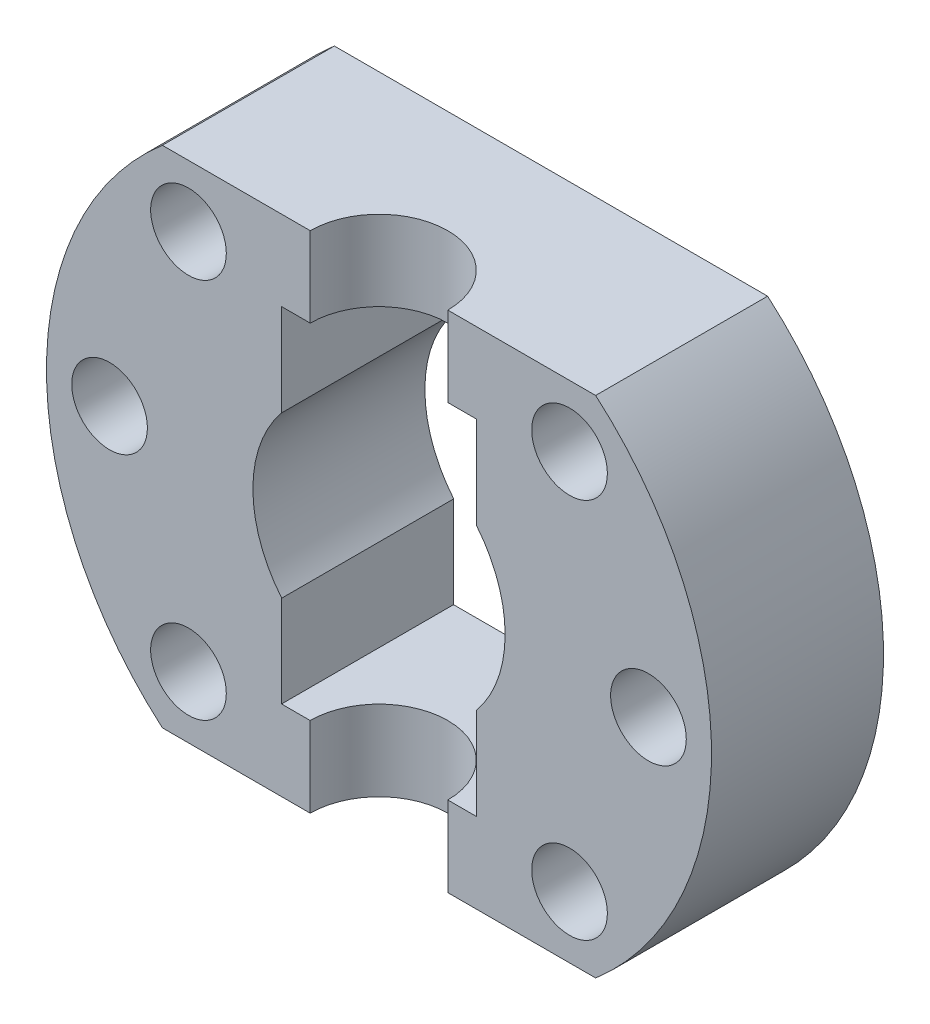
ISO-10303-21;
HEADER;
FILE_DESCRIPTION(('STEP AP214'),'2;1');
FILE_NAME('part.step','',(''),(''),'','','');
FILE_SCHEMA(('AUTOMOTIVE_DESIGN { 1 0 10303 214 1 1 1 1 }'));
ENDSEC;
DATA;
#1=APPLICATION_CONTEXT('core data for automotive mechanical design processes');
#2=APPLICATION_PROTOCOL_DEFINITION('international standard','automotive_design',2000,#1);
#3=PRODUCT_CONTEXT('',#1,'mechanical');
#4=PRODUCT('Part','Part','',(#3));
#5=PRODUCT_RELATED_PRODUCT_CATEGORY('part','',(#4));
#6=PRODUCT_DEFINITION_FORMATION('','',#4);
#7=PRODUCT_DEFINITION_CONTEXT('part definition',#1,'design');
#8=PRODUCT_DEFINITION('design','',#6,#7);
#9=PRODUCT_DEFINITION_SHAPE('','',#8);
#10=(LENGTH_UNIT() NAMED_UNIT(*) SI_UNIT(.MILLI.,.METRE.));
#11=(NAMED_UNIT(*) PLANE_ANGLE_UNIT() SI_UNIT($,.RADIAN.));
#12=(NAMED_UNIT(*) SI_UNIT($,.STERADIAN.) SOLID_ANGLE_UNIT());
#13=UNCERTAINTY_MEASURE_WITH_UNIT(LENGTH_MEASURE(1.E-05),#10,'distance_accuracy_value','');
#14=(GEOMETRIC_REPRESENTATION_CONTEXT(3) GLOBAL_UNCERTAINTY_ASSIGNED_CONTEXT((#13)) GLOBAL_UNIT_ASSIGNED_CONTEXT((#10,
#11,#12)) REPRESENTATION_CONTEXT('',''));
#15=CARTESIAN_POINT('',(0.,0.,0.));
#16=DIRECTION('',(0.,0.,1.));
#17=DIRECTION('',(1.,0.,0.));
#18=AXIS2_PLACEMENT_3D('',#15,#16,#17);
#19=CARTESIAN_POINT('',(0.,0.,15.));
#20=DIRECTION('',(0.,0.,1.));
#21=DIRECTION('',(1.,0.,0.));
#22=AXIS2_PLACEMENT_3D('',#19,#20,#21);
#23=PLANE('',#22);
#24=DIRECTION('',(0.,-1.,0.));
#25=VECTOR('',#24,1.);
#26=CARTESIAN_POINT('',(-6.00000000000001,22.,15.));
#27=LINE('',#26,#25);
#28=CARTESIAN_POINT('',(-6.00000000000001,22.,15.));
#29=VERTEX_POINT('',#28);
#30=CARTESIAN_POINT('',(-6.00000000000001,15.0178799781155,15.));
#31=VERTEX_POINT('',#30);
#32=EDGE_CURVE('E60',#29,#31,#27,.T.);
#33=ORIENTED_EDGE('',*,*,#32,.F.);
#34=DIRECTION('',(-1.,0.,0.));
#35=VECTOR('',#34,1.);
#36=CARTESIAN_POINT('',(-18.8944436276912,22.,15.));
#37=LINE('',#36,#35);
#38=CARTESIAN_POINT('',(-18.8944436276912,22.,15.));
#39=VERTEX_POINT('',#38);
#40=EDGE_CURVE('E183',#29,#39,#37,.T.);
#41=ORIENTED_EDGE('',*,*,#40,.T.);
#42=CARTESIAN_POINT('',(0.,0.,15.));
#43=DIRECTION('',(0.,0.,1.));
#44=DIRECTION('',(1.,0.,0.));
#45=AXIS2_PLACEMENT_3D('',#42,#43,#44);
#46=CIRCLE('',#45,29.);
#47=CARTESIAN_POINT('',(-18.8944436276912,-22.,15.));
#48=VERTEX_POINT('',#47);
#49=EDGE_CURVE('E208',#39,#48,#46,.T.);
#50=ORIENTED_EDGE('',*,*,#49,.T.);
#51=DIRECTION('',(1.,0.,0.));
#52=VECTOR('',#51,1.);
#53=CARTESIAN_POINT('',(-18.8944436276912,-22.,15.));
#54=LINE('',#53,#52);
#55=CARTESIAN_POINT('',(-6.00000000000001,-22.,15.));
#56=VERTEX_POINT('',#55);
#57=EDGE_CURVE('E337',#48,#56,#54,.T.);
#58=ORIENTED_EDGE('',*,*,#57,.T.);
#59=CARTESIAN_POINT('',(-6.00000000000001,-15.,15.));
#60=VERTEX_POINT('',#59);
#61=EDGE_CURVE('E353',#60,#56,#27,.T.);
#62=ORIENTED_EDGE('',*,*,#61,.F.);
#63=DIRECTION('',(1.,0.,0.));
#64=VECTOR('',#63,1.);
#65=CARTESIAN_POINT('',(-8.49999999999999,-15.,15.));
#66=LINE('',#65,#64);
#67=CARTESIAN_POINT('',(-8.49999999999999,-15.,15.));
#68=VERTEX_POINT('',#67);
#69=EDGE_CURVE('E368',#68,#60,#66,.T.);
#70=ORIENTED_EDGE('',*,*,#69,.F.);
#71=DIRECTION('',(0.,-1.,0.));
#72=VECTOR('',#71,1.);
#73=CARTESIAN_POINT('',(-8.49999999999999,-7.,15.));
#74=LINE('',#73,#72);
#75=CARTESIAN_POINT('',(-8.49999999999999,-7.,15.));
#76=VERTEX_POINT('',#75);
#77=EDGE_CURVE('E369',#76,#68,#74,.T.);
#78=ORIENTED_EDGE('',*,*,#77,.F.);
#79=DIRECTION('',(1.,0.,0.));
#80=VECTOR('',#79,1.);
#81=CARTESIAN_POINT('',(-8.49999999999999,-7.,15.));
#82=LINE('',#81,#80);
#83=CARTESIAN_POINT('',(-8.48528137423857,-7.,15.));
#84=VERTEX_POINT('',#83);
#85=EDGE_CURVE('E379',#76,#84,#82,.T.);
#86=ORIENTED_EDGE('',*,*,#85,.T.);
#87=CARTESIAN_POINT('',(0.,0.,15.));
#88=DIRECTION('',(0.,0.,1.));
#89=DIRECTION('',(1.,0.,0.));
#90=AXIS2_PLACEMENT_3D('',#87,#88,#89);
#91=CIRCLE('',#90,11.);
#92=CARTESIAN_POINT('',(-8.5,6.98212002188447,15.));
#93=VERTEX_POINT('',#92);
#94=EDGE_CURVE('E228',#93,#84,#91,.T.);
#95=ORIENTED_EDGE('',*,*,#94,.F.);
#96=DIRECTION('',(0.,-1.,0.));
#97=VECTOR('',#96,1.);
#98=CARTESIAN_POINT('',(-8.5,15.0178799781155,15.));
#99=LINE('',#98,#97);
#100=CARTESIAN_POINT('',(-8.5,15.0178799781155,15.));
#101=VERTEX_POINT('',#100);
#102=EDGE_CURVE('E373',#101,#93,#99,.T.);
#103=ORIENTED_EDGE('',*,*,#102,.F.);
#104=DIRECTION('',(1.,0.,0.));
#105=VECTOR('',#104,1.);
#106=CARTESIAN_POINT('',(-8.5,15.0178799781155,15.));
#107=LINE('',#106,#105);
#108=EDGE_CURVE('E350',#101,#31,#107,.T.);
#109=ORIENTED_EDGE('',*,*,#108,.T.);
#110=EDGE_LOOP('',(#33,#41,#50,#58,#62,#70,#78,#86,#95,#103,#109));
#111=FACE_BOUND('',#110,.T.);
#112=CARTESIAN_POINT('',(-16.6170093578839,-16.6170093578839,15.));
#113=DIRECTION('',(0.,0.,1.));
#114=DIRECTION('',(1.,0.,0.));
#115=AXIS2_PLACEMENT_3D('',#112,#113,#114);
#116=CIRCLE('',#115,3.29999999999986);
#117=CARTESIAN_POINT('',(-13.317009357884,-16.6170093578839,15.));
#118=VERTEX_POINT('',#117);
#119=EDGE_CURVE('E407',#118,#118,#116,.T.);
#120=ORIENTED_EDGE('',*,*,#119,.F.);
#121=EDGE_LOOP('',(#120));
#122=FACE_BOUND('',#121,.T.);
#123=CARTESIAN_POINT('',(-16.6170093578838,16.6170093578839,15.));
#124=DIRECTION('',(0.,0.,1.));
#125=DIRECTION('',(1.,0.,0.));
#126=AXIS2_PLACEMENT_3D('',#123,#124,#125);
#127=CIRCLE('',#126,3.3);
#128=CARTESIAN_POINT('',(-13.3170093578838,16.6170093578839,15.));
#129=VERTEX_POINT('',#128);
#130=EDGE_CURVE('E247',#129,#129,#127,.T.);
#131=ORIENTED_EDGE('',*,*,#130,.F.);
#132=EDGE_LOOP('',(#131));
#133=FACE_BOUND('',#132,.T.);
#134=CARTESIAN_POINT('',(-23.5,0.,15.));
#135=DIRECTION('',(0.,0.,1.));
#136=DIRECTION('',(1.,0.,0.));
#137=AXIS2_PLACEMENT_3D('',#134,#135,#136);
#138=CIRCLE('',#137,3.3);
#139=CARTESIAN_POINT('',(-20.2,0.,15.));
#140=VERTEX_POINT('',#139);
#141=EDGE_CURVE('E203',#140,#140,#138,.T.);
#142=ORIENTED_EDGE('',*,*,#141,.F.);
#143=EDGE_LOOP('',(#142));
#144=FACE_BOUND('',#143,.T.);
#145=ADVANCED_FACE('F45',(#111,#122,#133,#144),#23,.T.);
#146=DIRECTION('',(0.,-1.,0.));
#147=VECTOR('',#146,1.);
#148=CARTESIAN_POINT('',(5.99999999999999,22.,15.));
#149=LINE('',#148,#147);
#150=CARTESIAN_POINT('',(5.99999999999999,-22.,15.));
#151=VERTEX_POINT('',#150);
#152=CARTESIAN_POINT('',(5.99999999999999,-15.,15.));
#153=VERTEX_POINT('',#152);
#154=EDGE_CURVE('E68',#151,#153,#149,.F.);
#155=ORIENTED_EDGE('',*,*,#154,.F.);
#156=CARTESIAN_POINT('',(18.8944436276912,-22.,15.));
#157=VERTEX_POINT('',#156);
#158=EDGE_CURVE('E335',#151,#157,#54,.T.);
#159=ORIENTED_EDGE('',*,*,#158,.T.);
#160=CARTESIAN_POINT('',(0.,0.,15.));
#161=DIRECTION('',(0.,0.,1.));
#162=DIRECTION('',(1.,0.,0.));
#163=AXIS2_PLACEMENT_3D('',#160,#161,#162);
#164=CIRCLE('',#163,29.);
#165=CARTESIAN_POINT('',(18.8944436276912,22.,15.));
#166=VERTEX_POINT('',#165);
#167=EDGE_CURVE('E189',#157,#166,#164,.T.);
#168=ORIENTED_EDGE('',*,*,#167,.T.);
#169=CARTESIAN_POINT('',(5.99999999999999,22.,15.));
#170=VERTEX_POINT('',#169);
#171=EDGE_CURVE('E181',#166,#170,#37,.T.);
#172=ORIENTED_EDGE('',*,*,#171,.T.);
#173=CARTESIAN_POINT('',(5.99999999999999,15.0178799781155,15.));
#174=VERTEX_POINT('',#173);
#175=EDGE_CURVE('E167',#174,#170,#149,.F.);
#176=ORIENTED_EDGE('',*,*,#175,.F.);
#177=CARTESIAN_POINT('',(8.5,15.0178799781155,15.));
#178=VERTEX_POINT('',#177);
#179=EDGE_CURVE('E400',#174,#178,#107,.T.);
#180=ORIENTED_EDGE('',*,*,#179,.T.);
#181=DIRECTION('',(0.,-1.,0.));
#182=VECTOR('',#181,1.);
#183=CARTESIAN_POINT('',(8.5,15.0178799781155,15.));
#184=LINE('',#183,#182);
#185=CARTESIAN_POINT('',(8.5,6.98212002188447,15.));
#186=VERTEX_POINT('',#185);
#187=EDGE_CURVE('E399',#178,#186,#184,.T.);
#188=ORIENTED_EDGE('',*,*,#187,.T.);
#189=CARTESIAN_POINT('',(8.48528137423857,-7.,15.));
#190=VERTEX_POINT('',#189);
#191=EDGE_CURVE('E241',#190,#186,#91,.T.);
#192=ORIENTED_EDGE('',*,*,#191,.F.);
#193=CARTESIAN_POINT('',(8.5,-7.,15.));
#194=VERTEX_POINT('',#193);
#195=EDGE_CURVE('E378',#190,#194,#82,.T.);
#196=ORIENTED_EDGE('',*,*,#195,.T.);
#197=DIRECTION('',(0.,-1.,0.));
#198=VECTOR('',#197,1.);
#199=CARTESIAN_POINT('',(8.5,-7.,15.));
#200=LINE('',#199,#198);
#201=CARTESIAN_POINT('',(8.50000000000001,-15.,15.));
#202=VERTEX_POINT('',#201);
#203=EDGE_CURVE('E364',#194,#202,#200,.T.);
#204=ORIENTED_EDGE('',*,*,#203,.T.);
#205=EDGE_CURVE('E361',#153,#202,#66,.T.);
#206=ORIENTED_EDGE('',*,*,#205,.F.);
#207=EDGE_LOOP('',(#155,#159,#168,#172,#176,#180,#188,#192,#196,#204,#206));
#208=FACE_BOUND('',#207,.T.);
#209=CARTESIAN_POINT('',(16.6170093578837,-16.617009357884,15.));
#210=DIRECTION('',(0.,0.,1.));
#211=DIRECTION('',(1.,0.,0.));
#212=AXIS2_PLACEMENT_3D('',#209,#210,#211);
#213=CIRCLE('',#212,3.3);
#214=CARTESIAN_POINT('',(19.9170093578837,-16.617009357884,15.));
#215=VERTEX_POINT('',#214);
#216=EDGE_CURVE('E287',#215,#215,#213,.T.);
#217=ORIENTED_EDGE('',*,*,#216,.F.);
#218=EDGE_LOOP('',(#217));
#219=FACE_BOUND('',#218,.T.);
#220=CARTESIAN_POINT('',(16.617009357884,16.6170093578838,15.));
#221=DIRECTION('',(0.,0.,1.));
#222=DIRECTION('',(1.,0.,0.));
#223=AXIS2_PLACEMENT_3D('',#220,#221,#222);
#224=CIRCLE('',#223,3.3);
#225=CARTESIAN_POINT('',(19.917009357884,16.6170093578838,15.));
#226=VERTEX_POINT('',#225);
#227=EDGE_CURVE('E275',#226,#226,#224,.T.);
#228=ORIENTED_EDGE('',*,*,#227,.F.);
#229=EDGE_LOOP('',(#228));
#230=FACE_BOUND('',#229,.T.);
#231=CARTESIAN_POINT('',(23.5,-1.64099622925627E-13,15.));
#232=DIRECTION('',(0.,0.,1.));
#233=DIRECTION('',(1.,0.,0.));
#234=AXIS2_PLACEMENT_3D('',#231,#232,#233);
#235=CIRCLE('',#234,3.3);
#236=CARTESIAN_POINT('',(26.8,-1.64099622925627E-13,15.));
#237=VERTEX_POINT('',#236);
#238=EDGE_CURVE('E286',#237,#237,#235,.T.);
#239=ORIENTED_EDGE('',*,*,#238,.F.);
#240=EDGE_LOOP('',(#239));
#241=FACE_BOUND('',#240,.T.);
#242=ADVANCED_FACE('F186',(#208,#219,#230,#241),#23,.T.);
#243=CARTESIAN_POINT('',(0.,0.,0.));
#244=DIRECTION('',(0.,0.,1.));
#245=DIRECTION('',(1.,0.,0.));
#246=AXIS2_PLACEMENT_3D('',#243,#244,#245);
#247=PLANE('',#246);
#248=CARTESIAN_POINT('',(-16.6170093578839,-16.6170093578839,0.));
#249=DIRECTION('',(0.,0.,1.));
#250=DIRECTION('',(1.,0.,0.));
#251=AXIS2_PLACEMENT_3D('',#248,#249,#250);
#252=CIRCLE('',#251,3.29999999999986);
#253=CARTESIAN_POINT('',(-13.317009357884,-16.6170093578839,0.));
#254=VERTEX_POINT('',#253);
#255=EDGE_CURVE('E384',#254,#254,#252,.T.);
#256=ORIENTED_EDGE('',*,*,#255,.T.);
#257=EDGE_LOOP('',(#256));
#258=FACE_BOUND('',#257,.T.);
#259=CARTESIAN_POINT('',(16.6170093578837,-16.617009357884,0.));
#260=DIRECTION('',(0.,0.,1.));
#261=DIRECTION('',(1.,0.,0.));
#262=AXIS2_PLACEMENT_3D('',#259,#260,#261);
#263=CIRCLE('',#262,3.3);
#264=CARTESIAN_POINT('',(19.9170093578837,-16.617009357884,0.));
#265=VERTEX_POINT('',#264);
#266=EDGE_CURVE('E412',#265,#265,#263,.T.);
#267=ORIENTED_EDGE('',*,*,#266,.T.);
#268=EDGE_LOOP('',(#267));
#269=FACE_BOUND('',#268,.T.);
#270=CARTESIAN_POINT('',(23.5,-1.64099622925627E-13,0.));
#271=DIRECTION('',(0.,0.,1.));
#272=DIRECTION('',(1.,0.,0.));
#273=AXIS2_PLACEMENT_3D('',#270,#271,#272);
#274=CIRCLE('',#273,3.3);
#275=CARTESIAN_POINT('',(26.8,-1.64099622925627E-13,0.));
#276=VERTEX_POINT('',#275);
#277=EDGE_CURVE('E281',#276,#276,#274,.T.);
#278=ORIENTED_EDGE('',*,*,#277,.T.);
#279=EDGE_LOOP('',(#278));
#280=FACE_BOUND('',#279,.T.);
#281=CARTESIAN_POINT('',(16.617009357884,16.6170093578838,0.));
#282=DIRECTION('',(0.,0.,1.));
#283=DIRECTION('',(1.,0.,0.));
#284=AXIS2_PLACEMENT_3D('',#281,#282,#283);
#285=CIRCLE('',#284,3.3);
#286=CARTESIAN_POINT('',(19.917009357884,16.6170093578838,0.));
#287=VERTEX_POINT('',#286);
#288=EDGE_CURVE('E270',#287,#287,#285,.T.);
#289=ORIENTED_EDGE('',*,*,#288,.T.);
#290=EDGE_LOOP('',(#289));
#291=FACE_BOUND('',#290,.T.);
#292=CARTESIAN_POINT('',(-16.6170093578838,16.6170093578839,0.));
#293=DIRECTION('',(0.,0.,1.));
#294=DIRECTION('',(1.,0.,0.));
#295=AXIS2_PLACEMENT_3D('',#292,#293,#294);
#296=CIRCLE('',#295,3.3);
#297=CARTESIAN_POINT('',(-13.3170093578838,16.6170093578839,0.));
#298=VERTEX_POINT('',#297);
#299=EDGE_CURVE('E269',#298,#298,#296,.T.);
#300=ORIENTED_EDGE('',*,*,#299,.T.);
#301=EDGE_LOOP('',(#300));
#302=FACE_BOUND('',#301,.T.);
#303=CARTESIAN_POINT('',(-23.5,0.,0.));
#304=DIRECTION('',(0.,0.,1.));
#305=DIRECTION('',(1.,0.,0.));
#306=AXIS2_PLACEMENT_3D('',#303,#304,#305);
#307=CIRCLE('',#306,3.3);
#308=CARTESIAN_POINT('',(-20.2,0.,0.));
#309=VERTEX_POINT('',#308);
#310=EDGE_CURVE('E254',#309,#309,#307,.T.);
#311=ORIENTED_EDGE('',*,*,#310,.T.);
#312=EDGE_LOOP('',(#311));
#313=FACE_BOUND('',#312,.T.);
#314=CARTESIAN_POINT('',(0.,0.,0.));
#315=DIRECTION('',(0.,0.,1.));
#316=DIRECTION('',(1.,0.,0.));
#317=AXIS2_PLACEMENT_3D('',#314,#315,#316);
#318=CIRCLE('',#317,29.);
#319=CARTESIAN_POINT('',(-18.8944436276912,22.,0.));
#320=VERTEX_POINT('',#319);
#321=CARTESIAN_POINT('',(-18.8944436276912,-22.,0.));
#322=VERTEX_POINT('',#321);
#323=EDGE_CURVE('E199',#320,#322,#318,.T.);
#324=ORIENTED_EDGE('',*,*,#323,.F.);
#325=DIRECTION('',(-1.,0.,0.));
#326=VECTOR('',#325,1.);
#327=CARTESIAN_POINT('',(-18.8944436276912,22.,0.));
#328=LINE('',#327,#326);
#329=CARTESIAN_POINT('',(18.8944436276912,22.,0.));
#330=VERTEX_POINT('',#329);
#331=EDGE_CURVE('E207',#330,#320,#328,.T.);
#332=ORIENTED_EDGE('',*,*,#331,.F.);
#333=CARTESIAN_POINT('',(0.,0.,0.));
#334=DIRECTION('',(0.,0.,1.));
#335=DIRECTION('',(1.,0.,0.));
#336=AXIS2_PLACEMENT_3D('',#333,#334,#335);
#337=CIRCLE('',#336,29.);
#338=CARTESIAN_POINT('',(18.8944436276912,-22.,0.));
#339=VERTEX_POINT('',#338);
#340=EDGE_CURVE('E205',#339,#330,#337,.T.);
#341=ORIENTED_EDGE('',*,*,#340,.F.);
#342=DIRECTION('',(1.,0.,0.));
#343=VECTOR('',#342,1.);
#344=CARTESIAN_POINT('',(-18.8944436276912,-22.,0.));
#345=LINE('',#344,#343);
#346=EDGE_CURVE('E202',#322,#339,#345,.T.);
#347=ORIENTED_EDGE('',*,*,#346,.F.);
#348=EDGE_LOOP('',(#324,#332,#341,#347));
#349=FACE_BOUND('',#348,.T.);
#350=DIRECTION('',(1.,0.,0.));
#351=VECTOR('',#350,1.);
#352=CARTESIAN_POINT('',(-8.49999999999999,-7.,0.));
#353=LINE('',#352,#351);
#354=CARTESIAN_POINT('',(-8.49999999999999,-7.,0.));
#355=VERTEX_POINT('',#354);
#356=CARTESIAN_POINT('',(-8.48528137423857,-7.,0.));
#357=VERTEX_POINT('',#356);
#358=EDGE_CURVE('E237',#355,#357,#353,.T.);
#359=ORIENTED_EDGE('',*,*,#358,.F.);
#360=DIRECTION('',(0.,-1.,0.));
#361=VECTOR('',#360,1.);
#362=CARTESIAN_POINT('',(-8.49999999999999,-7.,0.));
#363=LINE('',#362,#361);
#364=CARTESIAN_POINT('',(-8.49999999999999,-15.,0.));
#365=VERTEX_POINT('',#364);
#366=EDGE_CURVE('E381',#355,#365,#363,.T.);
#367=ORIENTED_EDGE('',*,*,#366,.T.);
#368=DIRECTION('',(1.,0.,0.));
#369=VECTOR('',#368,1.);
#370=CARTESIAN_POINT('',(-8.49999999999999,-15.,0.));
#371=LINE('',#370,#369);
#372=CARTESIAN_POINT('',(8.50000000000001,-15.,0.));
#373=VERTEX_POINT('',#372);
#374=EDGE_CURVE('E463',#365,#373,#371,.T.);
#375=ORIENTED_EDGE('',*,*,#374,.T.);
#376=DIRECTION('',(0.,-1.,0.));
#377=VECTOR('',#376,1.);
#378=CARTESIAN_POINT('',(8.5,-7.,0.));
#379=LINE('',#378,#377);
#380=CARTESIAN_POINT('',(8.5,-7.,0.));
#381=VERTEX_POINT('',#380);
#382=EDGE_CURVE('E460',#381,#373,#379,.T.);
#383=ORIENTED_EDGE('',*,*,#382,.F.);
#384=CARTESIAN_POINT('',(8.48528137423857,-7.,0.));
#385=VERTEX_POINT('',#384);
#386=EDGE_CURVE('E458',#385,#381,#353,.T.);
#387=ORIENTED_EDGE('',*,*,#386,.F.);
#388=CARTESIAN_POINT('',(0.,0.,0.));
#389=DIRECTION('',(0.,0.,1.));
#390=DIRECTION('',(1.,0.,0.));
#391=AXIS2_PLACEMENT_3D('',#388,#389,#390);
#392=CIRCLE('',#391,11.);
#393=CARTESIAN_POINT('',(8.5,6.98212002188447,0.));
#394=VERTEX_POINT('',#393);
#395=EDGE_CURVE('E242',#385,#394,#392,.T.);
#396=ORIENTED_EDGE('',*,*,#395,.T.);
#397=DIRECTION('',(0.,-1.,0.));
#398=VECTOR('',#397,1.);
#399=CARTESIAN_POINT('',(8.5,15.0178799781155,0.));
#400=LINE('',#399,#398);
#401=CARTESIAN_POINT('',(8.5,15.0178799781155,0.));
#402=VERTEX_POINT('',#401);
#403=EDGE_CURVE('E405',#402,#394,#400,.T.);
#404=ORIENTED_EDGE('',*,*,#403,.F.);
#405=DIRECTION('',(1.,0.,0.));
#406=VECTOR('',#405,1.);
#407=CARTESIAN_POINT('',(-8.5,15.0178799781155,0.));
#408=LINE('',#407,#406);
#409=CARTESIAN_POINT('',(-8.5,15.0178799781155,0.));
#410=VERTEX_POINT('',#409);
#411=EDGE_CURVE('E393',#410,#402,#408,.T.);
#412=ORIENTED_EDGE('',*,*,#411,.F.);
#413=DIRECTION('',(0.,-1.,0.));
#414=VECTOR('',#413,1.);
#415=CARTESIAN_POINT('',(-8.5,15.0178799781155,0.));
#416=LINE('',#415,#414);
#417=CARTESIAN_POINT('',(-8.5,6.98212002188447,0.));
#418=VERTEX_POINT('',#417);
#419=EDGE_CURVE('E240',#410,#418,#416,.T.);
#420=ORIENTED_EDGE('',*,*,#419,.T.);
#421=EDGE_CURVE('E226',#418,#357,#392,.T.);
#422=ORIENTED_EDGE('',*,*,#421,.T.);
#423=EDGE_LOOP('',(#359,#367,#375,#383,#387,#396,#404,#412,#420,#422));
#424=FACE_BOUND('',#423,.T.);
#425=ADVANCED_FACE('F235',(#258,#269,#280,#291,#302,#313,#349,#424),#247,.F.);
#426=CARTESIAN_POINT('',(0.,0.,15.));
#427=DIRECTION('',(0.,0.,-1.));
#428=DIRECTION('',(-1.,0.,0.));
#429=AXIS2_PLACEMENT_3D('',#426,#427,#428);
#430=CYLINDRICAL_SURFACE('',#429,11.);
#431=ORIENTED_EDGE('',*,*,#94,.T.);
#432=DIRECTION('',(0.,0.,-1.));
#433=VECTOR('',#432,1.);
#434=CARTESIAN_POINT('',(-8.48528137423857,-7.,15.));
#435=LINE('',#434,#433);
#436=EDGE_CURVE('E53',#84,#357,#435,.T.);
#437=ORIENTED_EDGE('',*,*,#436,.T.);
#438=ORIENTED_EDGE('',*,*,#421,.F.);
#439=DIRECTION('',(0.,0.,1.));
#440=VECTOR('',#439,1.);
#441=CARTESIAN_POINT('',(-8.5,6.98212002188447,0.));
#442=LINE('',#441,#440);
#443=EDGE_CURVE('E391',#418,#93,#442,.T.);
#444=ORIENTED_EDGE('',*,*,#443,.T.);
#445=EDGE_LOOP('',(#431,#437,#438,#444));
#446=FACE_BOUND('',#445,.T.);
#447=ADVANCED_FACE('F224',(#446),#430,.F.);
#448=ORIENTED_EDGE('',*,*,#395,.F.);
#449=DIRECTION('',(0.,0.,-1.));
#450=VECTOR('',#449,1.);
#451=CARTESIAN_POINT('',(8.48528137423857,-7.,15.));
#452=LINE('',#451,#450);
#453=EDGE_CURVE('E217',#385,#190,#452,.F.);
#454=ORIENTED_EDGE('',*,*,#453,.T.);
#455=ORIENTED_EDGE('',*,*,#191,.T.);
#456=DIRECTION('',(0.,0.,1.));
#457=VECTOR('',#456,1.);
#458=CARTESIAN_POINT('',(8.5,6.98212002188447,0.));
#459=LINE('',#458,#457);
#460=EDGE_CURVE('E394',#394,#186,#459,.T.);
#461=ORIENTED_EDGE('',*,*,#460,.F.);
#462=EDGE_LOOP('',(#448,#454,#455,#461));
#463=FACE_BOUND('',#462,.T.);
#464=ADVANCED_FACE('F330',(#463),#430,.F.);
#465=CARTESIAN_POINT('',(0.,0.,15.));
#466=DIRECTION('',(0.,0.,-1.));
#467=DIRECTION('',(-1.,0.,0.));
#468=AXIS2_PLACEMENT_3D('',#465,#466,#467);
#469=CYLINDRICAL_SURFACE('',#468,29.);
#470=ORIENTED_EDGE('',*,*,#323,.T.);
#471=DIRECTION('',(0.,0.,-1.));
#472=VECTOR('',#471,1.);
#473=CARTESIAN_POINT('',(-18.8944436276912,-22.,15.));
#474=LINE('',#473,#472);
#475=EDGE_CURVE('E214',#48,#322,#474,.T.);
#476=ORIENTED_EDGE('',*,*,#475,.F.);
#477=ORIENTED_EDGE('',*,*,#49,.F.);
#478=DIRECTION('',(0.,0.,-1.));
#479=VECTOR('',#478,1.);
#480=CARTESIAN_POINT('',(-18.8944436276912,22.,15.));
#481=LINE('',#480,#479);
#482=EDGE_CURVE('E191',#39,#320,#481,.T.);
#483=ORIENTED_EDGE('',*,*,#482,.T.);
#484=EDGE_LOOP('',(#470,#476,#477,#483));
#485=FACE_BOUND('',#484,.T.);
#486=ADVANCED_FACE('F47',(#485),#469,.T.);
#487=CARTESIAN_POINT('',(-18.8944436276912,-22.,15.));
#488=DIRECTION('',(0.,1.,0.));
#489=DIRECTION('',(0.,0.,1.));
#490=AXIS2_PLACEMENT_3D('',#487,#488,#489);
#491=PLANE('',#490);
#492=ORIENTED_EDGE('',*,*,#158,.F.);
#493=CARTESIAN_POINT('',(0.,-22.,15.));
#494=DIRECTION('',(0.,-1.,0.));
#495=DIRECTION('',(0.,0.,-1.));
#496=AXIS2_PLACEMENT_3D('',#493,#494,#495);
#497=CIRCLE('',#496,6.);
#498=EDGE_CURVE('E184',#56,#151,#497,.T.);
#499=ORIENTED_EDGE('',*,*,#498,.F.);
#500=ORIENTED_EDGE('',*,*,#57,.F.);
#501=ORIENTED_EDGE('',*,*,#475,.T.);
#502=ORIENTED_EDGE('',*,*,#346,.T.);
#503=DIRECTION('',(0.,0.,-1.));
#504=VECTOR('',#503,1.);
#505=CARTESIAN_POINT('',(18.8944436276912,-22.,15.));
#506=LINE('',#505,#504);
#507=EDGE_CURVE('E211',#157,#339,#506,.T.);
#508=ORIENTED_EDGE('',*,*,#507,.F.);
#509=EDGE_LOOP('',(#492,#499,#500,#501,#502,#508));
#510=FACE_BOUND('',#509,.T.);
#511=ADVANCED_FACE('F323',(#510),#491,.F.);
#512=CARTESIAN_POINT('',(0.,0.,15.));
#513=DIRECTION('',(0.,0.,-1.));
#514=DIRECTION('',(-1.,0.,0.));
#515=AXIS2_PLACEMENT_3D('',#512,#513,#514);
#516=CYLINDRICAL_SURFACE('',#515,29.);
#517=ORIENTED_EDGE('',*,*,#340,.T.);
#518=DIRECTION('',(0.,0.,-1.));
#519=VECTOR('',#518,1.);
#520=CARTESIAN_POINT('',(18.8944436276912,22.,15.));
#521=LINE('',#520,#519);
#522=EDGE_CURVE('E194',#166,#330,#521,.T.);
#523=ORIENTED_EDGE('',*,*,#522,.F.);
#524=ORIENTED_EDGE('',*,*,#167,.F.);
#525=ORIENTED_EDGE('',*,*,#507,.T.);
#526=EDGE_LOOP('',(#517,#523,#524,#525));
#527=FACE_BOUND('',#526,.T.);
#528=ADVANCED_FACE('F321',(#527),#516,.T.);
#529=CARTESIAN_POINT('',(-18.8944436276912,22.,15.));
#530=DIRECTION('',(0.,-1.,0.));
#531=DIRECTION('',(0.,0.,-1.));
#532=AXIS2_PLACEMENT_3D('',#529,#530,#531);
#533=PLANE('',#532);
#534=ORIENTED_EDGE('',*,*,#40,.F.);
#535=CARTESIAN_POINT('',(0.,22.,15.));
#536=DIRECTION('',(0.,-1.,0.));
#537=DIRECTION('',(0.,0.,-1.));
#538=AXIS2_PLACEMENT_3D('',#535,#536,#537);
#539=CIRCLE('',#538,6.);
#540=EDGE_CURVE('E170',#29,#170,#539,.T.);
#541=ORIENTED_EDGE('',*,*,#540,.T.);
#542=ORIENTED_EDGE('',*,*,#171,.F.);
#543=ORIENTED_EDGE('',*,*,#522,.T.);
#544=ORIENTED_EDGE('',*,*,#331,.T.);
#545=ORIENTED_EDGE('',*,*,#482,.F.);
#546=EDGE_LOOP('',(#534,#541,#542,#543,#544,#545));
#547=FACE_BOUND('',#546,.T.);
#548=ADVANCED_FACE('F179',(#547),#533,.F.);
#549=CARTESIAN_POINT('',(-23.5,0.,15.));
#550=DIRECTION('',(0.,0.,-1.));
#551=DIRECTION('',(-1.,0.,0.));
#552=AXIS2_PLACEMENT_3D('',#549,#550,#551);
#553=CYLINDRICAL_SURFACE('',#552,3.3);
#554=ORIENTED_EDGE('',*,*,#141,.T.);
#555=EDGE_LOOP('',(#554));
#556=FACE_BOUND('',#555,.T.);
#557=ORIENTED_EDGE('',*,*,#310,.F.);
#558=EDGE_LOOP('',(#557));
#559=FACE_BOUND('',#558,.T.);
#560=ADVANCED_FACE('F316',(#556,#559),#553,.F.);
#561=CARTESIAN_POINT('',(-16.6170093578838,16.6170093578839,15.));
#562=DIRECTION('',(0.,0.,-1.));
#563=DIRECTION('',(-1.,0.,0.));
#564=AXIS2_PLACEMENT_3D('',#561,#562,#563);
#565=CYLINDRICAL_SURFACE('',#564,3.3);
#566=ORIENTED_EDGE('',*,*,#130,.T.);
#567=EDGE_LOOP('',(#566));
#568=FACE_BOUND('',#567,.T.);
#569=ORIENTED_EDGE('',*,*,#299,.F.);
#570=EDGE_LOOP('',(#569));
#571=FACE_BOUND('',#570,.T.);
#572=ADVANCED_FACE('F442',(#568,#571),#565,.F.);
#573=CARTESIAN_POINT('',(16.617009357884,16.6170093578838,15.));
#574=DIRECTION('',(0.,0.,-1.));
#575=DIRECTION('',(-1.,0.,0.));
#576=AXIS2_PLACEMENT_3D('',#573,#574,#575);
#577=CYLINDRICAL_SURFACE('',#576,3.3);
#578=ORIENTED_EDGE('',*,*,#227,.T.);
#579=EDGE_LOOP('',(#578));
#580=FACE_BOUND('',#579,.T.);
#581=ORIENTED_EDGE('',*,*,#288,.F.);
#582=EDGE_LOOP('',(#581));
#583=FACE_BOUND('',#582,.T.);
#584=ADVANCED_FACE('F436',(#580,#583),#577,.F.);
#585=CARTESIAN_POINT('',(23.5,-1.64099622925627E-13,15.));
#586=DIRECTION('',(0.,0.,-1.));
#587=DIRECTION('',(-1.,0.,0.));
#588=AXIS2_PLACEMENT_3D('',#585,#586,#587);
#589=CYLINDRICAL_SURFACE('',#588,3.3);
#590=ORIENTED_EDGE('',*,*,#238,.T.);
#591=EDGE_LOOP('',(#590));
#592=FACE_BOUND('',#591,.T.);
#593=ORIENTED_EDGE('',*,*,#277,.F.);
#594=EDGE_LOOP('',(#593));
#595=FACE_BOUND('',#594,.T.);
#596=ADVANCED_FACE('F303',(#592,#595),#589,.F.);
#597=CARTESIAN_POINT('',(16.6170093578837,-16.617009357884,15.));
#598=DIRECTION('',(0.,0.,-1.));
#599=DIRECTION('',(-1.,0.,0.));
#600=AXIS2_PLACEMENT_3D('',#597,#598,#599);
#601=CYLINDRICAL_SURFACE('',#600,3.3);
#602=ORIENTED_EDGE('',*,*,#216,.T.);
#603=EDGE_LOOP('',(#602));
#604=FACE_BOUND('',#603,.T.);
#605=ORIENTED_EDGE('',*,*,#266,.F.);
#606=EDGE_LOOP('',(#605));
#607=FACE_BOUND('',#606,.T.);
#608=ADVANCED_FACE('F424',(#604,#607),#601,.F.);
#609=CARTESIAN_POINT('',(-16.6170093578839,-16.6170093578839,15.));
#610=DIRECTION('',(0.,0.,-1.));
#611=DIRECTION('',(-1.,0.,0.));
#612=AXIS2_PLACEMENT_3D('',#609,#610,#611);
#613=CYLINDRICAL_SURFACE('',#612,3.29999999999986);
#614=ORIENTED_EDGE('',*,*,#119,.T.);
#615=EDGE_LOOP('',(#614));
#616=FACE_BOUND('',#615,.T.);
#617=ORIENTED_EDGE('',*,*,#255,.F.);
#618=EDGE_LOOP('',(#617));
#619=FACE_BOUND('',#618,.T.);
#620=ADVANCED_FACE('F426',(#616,#619),#613,.F.);
#621=CARTESIAN_POINT('',(-8.5,15.0178799781155,0.));
#622=DIRECTION('',(-1.,0.,0.));
#623=DIRECTION('',(0.,0.,1.));
#624=AXIS2_PLACEMENT_3D('',#621,#622,#623);
#625=PLANE('',#624);
#626=ORIENTED_EDGE('',*,*,#102,.T.);
#627=ORIENTED_EDGE('',*,*,#443,.F.);
#628=ORIENTED_EDGE('',*,*,#419,.F.);
#629=DIRECTION('',(0.,0.,1.));
#630=VECTOR('',#629,1.);
#631=CARTESIAN_POINT('',(-8.5,15.0178799781155,0.));
#632=LINE('',#631,#630);
#633=EDGE_CURVE('E351',#410,#101,#632,.T.);
#634=ORIENTED_EDGE('',*,*,#633,.T.);
#635=EDGE_LOOP('',(#626,#627,#628,#634));
#636=FACE_BOUND('',#635,.T.);
#637=ADVANCED_FACE('F433',(#636),#625,.F.);
#638=CARTESIAN_POINT('',(-8.5,15.0178799781155,0.));
#639=DIRECTION('',(0.,-1.,0.));
#640=DIRECTION('',(0.,0.,-1.));
#641=AXIS2_PLACEMENT_3D('',#638,#639,#640);
#642=PLANE('',#641);
#643=CARTESIAN_POINT('',(0.,15.0178799781155,15.));
#644=DIRECTION('',(0.,-1.,0.));
#645=DIRECTION('',(0.,0.,-1.));
#646=AXIS2_PLACEMENT_3D('',#643,#644,#645);
#647=CIRCLE('',#646,6.);
#648=EDGE_CURVE('E171',#31,#174,#647,.T.);
#649=ORIENTED_EDGE('',*,*,#648,.F.);
#650=ORIENTED_EDGE('',*,*,#108,.F.);
#651=ORIENTED_EDGE('',*,*,#633,.F.);
#652=ORIENTED_EDGE('',*,*,#411,.T.);
#653=DIRECTION('',(0.,0.,1.));
#654=VECTOR('',#653,1.);
#655=CARTESIAN_POINT('',(8.5,15.0178799781155,0.));
#656=LINE('',#655,#654);
#657=EDGE_CURVE('E354',#402,#178,#656,.T.);
#658=ORIENTED_EDGE('',*,*,#657,.T.);
#659=ORIENTED_EDGE('',*,*,#179,.F.);
#660=EDGE_LOOP('',(#649,#650,#651,#652,#658,#659));
#661=FACE_BOUND('',#660,.T.);
#662=ADVANCED_FACE('F482',(#661),#642,.T.);
#663=CARTESIAN_POINT('',(8.5,15.0178799781155,0.));
#664=DIRECTION('',(-1.,0.,0.));
#665=DIRECTION('',(0.,0.,1.));
#666=AXIS2_PLACEMENT_3D('',#663,#664,#665);
#667=PLANE('',#666);
#668=ORIENTED_EDGE('',*,*,#187,.F.);
#669=ORIENTED_EDGE('',*,*,#657,.F.);
#670=ORIENTED_EDGE('',*,*,#403,.T.);
#671=ORIENTED_EDGE('',*,*,#460,.T.);
#672=EDGE_LOOP('',(#668,#669,#670,#671));
#673=FACE_BOUND('',#672,.T.);
#674=ADVANCED_FACE('F480',(#673),#667,.T.);
#675=CARTESIAN_POINT('',(-8.49999999999999,-7.,0.));
#676=DIRECTION('',(0.,-1.,0.));
#677=DIRECTION('',(0.,0.,-1.));
#678=AXIS2_PLACEMENT_3D('',#675,#676,#677);
#679=PLANE('',#678);
#680=ORIENTED_EDGE('',*,*,#85,.F.);
#681=DIRECTION('',(0.,0.,1.));
#682=VECTOR('',#681,1.);
#683=CARTESIAN_POINT('',(-8.49999999999999,-7.,0.));
#684=LINE('',#683,#682);
#685=EDGE_CURVE('E382',#355,#76,#684,.T.);
#686=ORIENTED_EDGE('',*,*,#685,.F.);
#687=ORIENTED_EDGE('',*,*,#358,.T.);
#688=ORIENTED_EDGE('',*,*,#436,.F.);
#689=EDGE_LOOP('',(#680,#686,#687,#688));
#690=FACE_BOUND('',#689,.T.);
#691=ADVANCED_FACE('F555',(#690),#679,.T.);
#692=CARTESIAN_POINT('',(-8.49999999999999,-7.,0.));
#693=DIRECTION('',(-1.,0.,0.));
#694=DIRECTION('',(0.,0.,1.));
#695=AXIS2_PLACEMENT_3D('',#692,#693,#694);
#696=PLANE('',#695);
#697=ORIENTED_EDGE('',*,*,#77,.T.);
#698=DIRECTION('',(0.,0.,1.));
#699=VECTOR('',#698,1.);
#700=CARTESIAN_POINT('',(-8.49999999999999,-15.,0.));
#701=LINE('',#700,#699);
#702=EDGE_CURVE('E389',#365,#68,#701,.T.);
#703=ORIENTED_EDGE('',*,*,#702,.F.);
#704=ORIENTED_EDGE('',*,*,#366,.F.);
#705=ORIENTED_EDGE('',*,*,#685,.T.);
#706=EDGE_LOOP('',(#697,#703,#704,#705));
#707=FACE_BOUND('',#706,.T.);
#708=ADVANCED_FACE('F470',(#707),#696,.F.);
#709=ORIENTED_EDGE('',*,*,#386,.T.);
#710=DIRECTION('',(0.,0.,1.));
#711=VECTOR('',#710,1.);
#712=CARTESIAN_POINT('',(8.5,-7.,0.));
#713=LINE('',#712,#711);
#714=EDGE_CURVE('E385',#381,#194,#713,.T.);
#715=ORIENTED_EDGE('',*,*,#714,.T.);
#716=ORIENTED_EDGE('',*,*,#195,.F.);
#717=ORIENTED_EDGE('',*,*,#453,.F.);
#718=EDGE_LOOP('',(#709,#715,#716,#717));
#719=FACE_BOUND('',#718,.T.);
#720=ADVANCED_FACE('F476',(#719),#679,.T.);
#721=CARTESIAN_POINT('',(8.5,-7.,0.));
#722=DIRECTION('',(-1.,0.,0.));
#723=DIRECTION('',(0.,-1.,0.));
#724=AXIS2_PLACEMENT_3D('',#721,#722,#723);
#725=PLANE('',#724);
#726=ORIENTED_EDGE('',*,*,#203,.F.);
#727=ORIENTED_EDGE('',*,*,#714,.F.);
#728=ORIENTED_EDGE('',*,*,#382,.T.);
#729=DIRECTION('',(0.,0.,1.));
#730=VECTOR('',#729,1.);
#731=CARTESIAN_POINT('',(8.50000000000001,-15.,0.));
#732=LINE('',#731,#730);
#733=EDGE_CURVE('E387',#373,#202,#732,.T.);
#734=ORIENTED_EDGE('',*,*,#733,.T.);
#735=EDGE_LOOP('',(#726,#727,#728,#734));
#736=FACE_BOUND('',#735,.T.);
#737=ADVANCED_FACE('F475',(#736),#725,.T.);
#738=CARTESIAN_POINT('',(-8.49999999999999,-15.,0.));
#739=DIRECTION('',(0.,-1.,0.));
#740=DIRECTION('',(0.,0.,-1.));
#741=AXIS2_PLACEMENT_3D('',#738,#739,#740);
#742=PLANE('',#741);
#743=ORIENTED_EDGE('',*,*,#69,.T.);
#744=CARTESIAN_POINT('',(0.,-15.,15.));
#745=DIRECTION('',(0.,-1.,0.));
#746=DIRECTION('',(0.,0.,-1.));
#747=AXIS2_PLACEMENT_3D('',#744,#745,#746);
#748=CIRCLE('',#747,6.);
#749=EDGE_CURVE('E12',#60,#153,#748,.T.);
#750=ORIENTED_EDGE('',*,*,#749,.T.);
#751=ORIENTED_EDGE('',*,*,#205,.T.);
#752=ORIENTED_EDGE('',*,*,#733,.F.);
#753=ORIENTED_EDGE('',*,*,#374,.F.);
#754=ORIENTED_EDGE('',*,*,#702,.T.);
#755=EDGE_LOOP('',(#743,#750,#751,#752,#753,#754));
#756=FACE_BOUND('',#755,.T.);
#757=ADVANCED_FACE('F473',(#756),#742,.F.);
#758=CARTESIAN_POINT('',(0.,22.,15.));
#759=DIRECTION('',(0.,-1.,0.));
#760=DIRECTION('',(0.,0.,-1.));
#761=AXIS2_PLACEMENT_3D('',#758,#759,#760);
#762=CYLINDRICAL_SURFACE('',#761,6.);
#763=ORIENTED_EDGE('',*,*,#61,.T.);
#764=ORIENTED_EDGE('',*,*,#498,.T.);
#765=ORIENTED_EDGE('',*,*,#154,.T.);
#766=ORIENTED_EDGE('',*,*,#749,.F.);
#767=EDGE_LOOP('',(#763,#764,#765,#766));
#768=FACE_BOUND('',#767,.T.);
#769=ADVANCED_FACE('F358',(#768),#762,.F.);
#770=ORIENTED_EDGE('',*,*,#32,.T.);
#771=ORIENTED_EDGE('',*,*,#648,.T.);
#772=ORIENTED_EDGE('',*,*,#175,.T.);
#773=ORIENTED_EDGE('',*,*,#540,.F.);
#774=EDGE_LOOP('',(#770,#771,#772,#773));
#775=FACE_BOUND('',#774,.T.);
#776=ADVANCED_FACE('F169',(#775),#762,.F.);
#777=CLOSED_SHELL('',(#145,#242,#425,#447,#464,#486,#511,#528,#548,#560,#572,#584,#596,#608,
#620,#637,#662,#674,#691,#708,#720,#737,#757,#769,#776));
#778=MANIFOLD_SOLID_BREP('B2',#777);
#779=ADVANCED_BREP_SHAPE_REPRESENTATION('',(#18,#778),#14);
#780=SHAPE_DEFINITION_REPRESENTATION(#9,#779);
ENDSEC;
END-ISO-10303-21;
